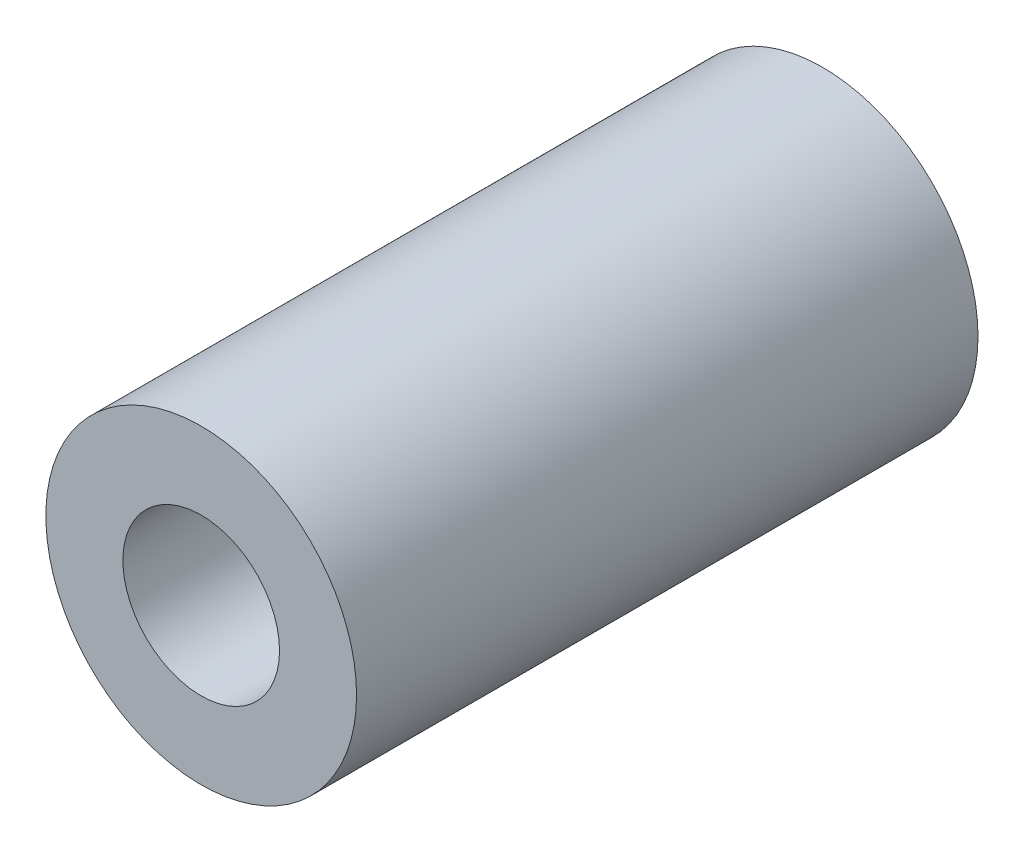
ISO-10303-21;
HEADER;
FILE_DESCRIPTION(('STEP AP214'),'2;1');
FILE_NAME('part.step','',(''),(''),'','','');
FILE_SCHEMA(('AUTOMOTIVE_DESIGN { 1 0 10303 214 1 1 1 1 }'));
ENDSEC;
DATA;
#1=APPLICATION_CONTEXT('core data for automotive mechanical design processes');
#2=APPLICATION_PROTOCOL_DEFINITION('international standard','automotive_design',2000,#1);
#3=PRODUCT_CONTEXT('',#1,'mechanical');
#4=PRODUCT('Part','Part','',(#3));
#5=PRODUCT_RELATED_PRODUCT_CATEGORY('part','',(#4));
#6=PRODUCT_DEFINITION_FORMATION('','',#4);
#7=PRODUCT_DEFINITION_CONTEXT('part definition',#1,'design');
#8=PRODUCT_DEFINITION('design','',#6,#7);
#9=PRODUCT_DEFINITION_SHAPE('','',#8);
#10=(LENGTH_UNIT() NAMED_UNIT(*) SI_UNIT(.MILLI.,.METRE.));
#11=(NAMED_UNIT(*) PLANE_ANGLE_UNIT() SI_UNIT($,.RADIAN.));
#12=(NAMED_UNIT(*) SI_UNIT($,.STERADIAN.) SOLID_ANGLE_UNIT());
#13=UNCERTAINTY_MEASURE_WITH_UNIT(LENGTH_MEASURE(1.E-05),#10,'distance_accuracy_value','');
#14=(GEOMETRIC_REPRESENTATION_CONTEXT(3) GLOBAL_UNCERTAINTY_ASSIGNED_CONTEXT((#13)) GLOBAL_UNIT_ASSIGNED_CONTEXT((#10,
#11,#12)) REPRESENTATION_CONTEXT('',''));
#15=CARTESIAN_POINT('',(0.,0.,0.));
#16=DIRECTION('',(0.,0.,1.));
#17=DIRECTION('',(1.,0.,0.));
#18=AXIS2_PLACEMENT_3D('',#15,#16,#17);
#19=CARTESIAN_POINT('',(0.,0.,12.7));
#20=DIRECTION('',(0.,0.,1.));
#21=DIRECTION('',(1.,0.,0.));
#22=AXIS2_PLACEMENT_3D('',#19,#20,#21);
#23=PLANE('',#22);
#24=CARTESIAN_POINT('',(0.,0.,12.7));
#25=DIRECTION('',(0.,0.,1.));
#26=DIRECTION('',(1.,0.,0.));
#27=AXIS2_PLACEMENT_3D('',#24,#25,#26);
#28=CIRCLE('',#27,6.35);
#29=CARTESIAN_POINT('',(6.35,0.,12.7));
#30=VERTEX_POINT('',#29);
#31=EDGE_CURVE('E10',#30,#30,#28,.T.);
#32=ORIENTED_EDGE('',*,*,#31,.T.);
#33=EDGE_LOOP('',(#32));
#34=FACE_BOUND('',#33,.T.);
#35=CARTESIAN_POINT('',(0.,0.,12.7));
#36=DIRECTION('',(0.,0.,1.));
#37=DIRECTION('',(1.,0.,0.));
#38=AXIS2_PLACEMENT_3D('',#35,#36,#37);
#39=CIRCLE('',#38,3.2004);
#40=CARTESIAN_POINT('',(3.2004,0.,12.7));
#41=VERTEX_POINT('',#40);
#42=EDGE_CURVE('E37',#41,#41,#39,.T.);
#43=ORIENTED_EDGE('',*,*,#42,.F.);
#44=EDGE_LOOP('',(#43));
#45=FACE_BOUND('',#44,.T.);
#46=ADVANCED_FACE('F30',(#34,#45),#23,.T.);
#47=CARTESIAN_POINT('',(0.,0.,12.7));
#48=DIRECTION('',(0.,0.,-1.));
#49=DIRECTION('',(-1.,0.,0.));
#50=AXIS2_PLACEMENT_3D('',#47,#48,#49);
#51=CYLINDRICAL_SURFACE('',#50,6.35);
#52=ORIENTED_EDGE('',*,*,#31,.F.);
#53=EDGE_LOOP('',(#52));
#54=FACE_BOUND('',#53,.T.);
#55=CARTESIAN_POINT('',(0.,0.,-12.7));
#56=DIRECTION('',(0.,0.,1.));
#57=DIRECTION('',(1.,0.,0.));
#58=AXIS2_PLACEMENT_3D('',#55,#56,#57);
#59=CIRCLE('',#58,6.35);
#60=CARTESIAN_POINT('',(6.35,0.,-12.7));
#61=VERTEX_POINT('',#60);
#62=EDGE_CURVE('E41',#61,#61,#59,.T.);
#63=ORIENTED_EDGE('',*,*,#62,.T.);
#64=EDGE_LOOP('',(#63));
#65=FACE_BOUND('',#64,.T.);
#66=ADVANCED_FACE('F32',(#54,#65),#51,.T.);
#67=CARTESIAN_POINT('',(0.,0.,12.7));
#68=DIRECTION('',(0.,0.,-1.));
#69=DIRECTION('',(-1.,0.,0.));
#70=AXIS2_PLACEMENT_3D('',#67,#68,#69);
#71=CYLINDRICAL_SURFACE('',#70,3.2004);
#72=ORIENTED_EDGE('',*,*,#42,.T.);
#73=EDGE_LOOP('',(#72));
#74=FACE_BOUND('',#73,.T.);
#75=CARTESIAN_POINT('',(0.,0.,-12.7));
#76=DIRECTION('',(0.,0.,1.));
#77=DIRECTION('',(1.,0.,0.));
#78=AXIS2_PLACEMENT_3D('',#75,#76,#77);
#79=CIRCLE('',#78,3.2004);
#80=CARTESIAN_POINT('',(3.2004,0.,-12.7));
#81=VERTEX_POINT('',#80);
#82=EDGE_CURVE('E45',#81,#81,#79,.T.);
#83=ORIENTED_EDGE('',*,*,#82,.F.);
#84=EDGE_LOOP('',(#83));
#85=FACE_BOUND('',#84,.T.);
#86=ADVANCED_FACE('F54',(#74,#85),#71,.F.);
#87=CARTESIAN_POINT('',(0.,0.,-12.7));
#88=DIRECTION('',(0.,0.,1.));
#89=DIRECTION('',(1.,0.,0.));
#90=AXIS2_PLACEMENT_3D('',#87,#88,#89);
#91=PLANE('',#90);
#92=ORIENTED_EDGE('',*,*,#82,.T.);
#93=EDGE_LOOP('',(#92));
#94=FACE_BOUND('',#93,.T.);
#95=ORIENTED_EDGE('',*,*,#62,.F.);
#96=EDGE_LOOP('',(#95));
#97=FACE_BOUND('',#96,.T.);
#98=ADVANCED_FACE('F51',(#94,#97),#91,.F.);
#99=CLOSED_SHELL('',(#46,#66,#86,#98));
#100=MANIFOLD_SOLID_BREP('B2',#99);
#101=ADVANCED_BREP_SHAPE_REPRESENTATION('',(#18,#100),#14);
#102=SHAPE_DEFINITION_REPRESENTATION(#9,#101);
ENDSEC;
END-ISO-10303-21;
